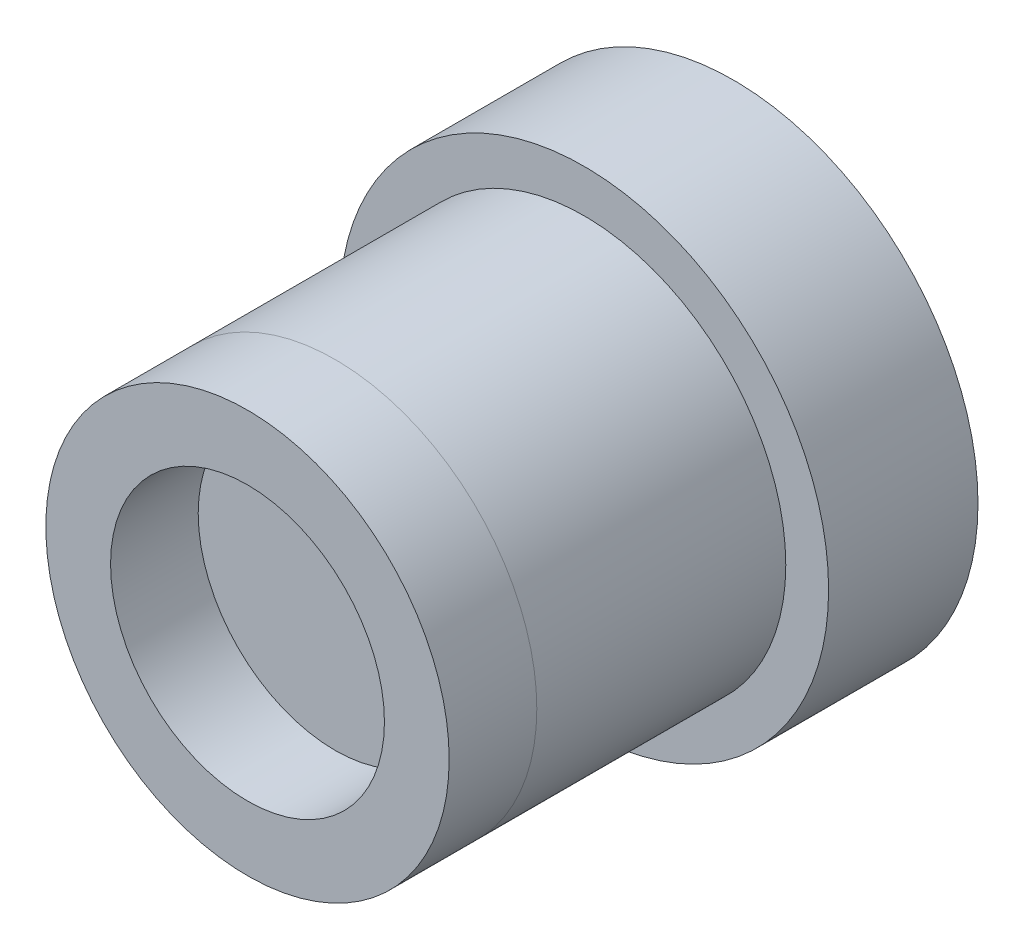
ISO-10303-21;
HEADER;
FILE_DESCRIPTION(('STEP AP214'),'2;1');
FILE_NAME('part.step','',(''),(''),'','','');
FILE_SCHEMA(('AUTOMOTIVE_DESIGN { 1 0 10303 214 1 1 1 1 }'));
ENDSEC;
DATA;
#1=APPLICATION_CONTEXT('core data for automotive mechanical design processes');
#2=APPLICATION_PROTOCOL_DEFINITION('international standard','automotive_design',2000,#1);
#3=PRODUCT_CONTEXT('',#1,'mechanical');
#4=PRODUCT('Part','Part','',(#3));
#5=PRODUCT_RELATED_PRODUCT_CATEGORY('part','',(#4));
#6=PRODUCT_DEFINITION_FORMATION('','',#4);
#7=PRODUCT_DEFINITION_CONTEXT('part definition',#1,'design');
#8=PRODUCT_DEFINITION('design','',#6,#7);
#9=PRODUCT_DEFINITION_SHAPE('','',#8);
#10=(LENGTH_UNIT() NAMED_UNIT(*) SI_UNIT(.MILLI.,.METRE.));
#11=(NAMED_UNIT(*) PLANE_ANGLE_UNIT() SI_UNIT($,.RADIAN.));
#12=(NAMED_UNIT(*) SI_UNIT($,.STERADIAN.) SOLID_ANGLE_UNIT());
#13=UNCERTAINTY_MEASURE_WITH_UNIT(LENGTH_MEASURE(1.E-05),#10,'distance_accuracy_value','');
#14=(GEOMETRIC_REPRESENTATION_CONTEXT(3) GLOBAL_UNCERTAINTY_ASSIGNED_CONTEXT((#13)) GLOBAL_UNIT_ASSIGNED_CONTEXT((#10,
#11,#12)) REPRESENTATION_CONTEXT('',''));
#15=CARTESIAN_POINT('',(0.,0.,0.));
#16=DIRECTION('',(0.,0.,1.));
#17=DIRECTION('',(1.,0.,0.));
#18=AXIS2_PLACEMENT_3D('',#15,#16,#17);
#19=CARTESIAN_POINT('',(0.,0.,9.76));
#20=DIRECTION('',(0.,0.,1.));
#21=DIRECTION('',(1.,0.,0.));
#22=AXIS2_PLACEMENT_3D('',#19,#20,#21);
#23=PLANE('',#22);
#24=CARTESIAN_POINT('',(0.,0.,9.76));
#25=DIRECTION('',(0.,0.,1.));
#26=DIRECTION('',(1.,0.,0.));
#27=AXIS2_PLACEMENT_3D('',#24,#25,#26);
#28=CIRCLE('',#27,4.05);
#29=CARTESIAN_POINT('',(4.05,0.,9.76));
#30=VERTEX_POINT('',#29);
#31=EDGE_CURVE('E11',#30,#30,#28,.T.);
#32=ORIENTED_EDGE('',*,*,#31,.T.);
#33=EDGE_LOOP('',(#32));
#34=FACE_BOUND('',#33,.T.);
#35=CARTESIAN_POINT('',(0.,0.,9.76));
#36=DIRECTION('',(0.,0.,1.));
#37=DIRECTION('',(1.,0.,0.));
#38=AXIS2_PLACEMENT_3D('',#35,#36,#37);
#39=CIRCLE('',#38,2.75);
#40=CARTESIAN_POINT('',(2.75,0.,9.76));
#41=VERTEX_POINT('',#40);
#42=EDGE_CURVE('E58',#41,#41,#39,.T.);
#43=ORIENTED_EDGE('',*,*,#42,.F.);
#44=EDGE_LOOP('',(#43));
#45=FACE_BOUND('',#44,.T.);
#46=ADVANCED_FACE('F47',(#34,#45),#23,.T.);
#47=CARTESIAN_POINT('',(0.,0.,8.));
#48=DIRECTION('',(0.,0.,1.));
#49=DIRECTION('',(1.,0.,0.));
#50=AXIS2_PLACEMENT_3D('',#47,#48,#49);
#51=PLANE('',#50);
#52=CARTESIAN_POINT('',(0.,0.,8.));
#53=DIRECTION('',(0.,0.,1.));
#54=DIRECTION('',(1.,0.,0.));
#55=AXIS2_PLACEMENT_3D('',#52,#53,#54);
#56=CIRCLE('',#55,4.05);
#57=CARTESIAN_POINT('',(4.05,0.,8.));
#58=VERTEX_POINT('',#57);
#59=EDGE_CURVE('E51',#58,#58,#56,.T.);
#60=ORIENTED_EDGE('',*,*,#59,.F.);
#61=EDGE_LOOP('',(#60));
#62=FACE_BOUND('',#61,.T.);
#63=CARTESIAN_POINT('',(0.,0.,8.));
#64=DIRECTION('',(0.,0.,1.));
#65=DIRECTION('',(1.,0.,0.));
#66=AXIS2_PLACEMENT_3D('',#63,#64,#65);
#67=CIRCLE('',#66,2.75);
#68=CARTESIAN_POINT('',(2.75,0.,8.));
#69=VERTEX_POINT('',#68);
#70=EDGE_CURVE('E60',#69,#69,#67,.T.);
#71=ORIENTED_EDGE('',*,*,#70,.T.);
#72=EDGE_LOOP('',(#71));
#73=FACE_BOUND('',#72,.T.);
#74=ADVANCED_FACE('F70',(#62,#73),#51,.F.);
#75=CARTESIAN_POINT('',(0.,0.,9.76));
#76=DIRECTION('',(0.,0.,-1.));
#77=DIRECTION('',(-1.,0.,0.));
#78=AXIS2_PLACEMENT_3D('',#75,#76,#77);
#79=CYLINDRICAL_SURFACE('',#78,4.05);
#80=ORIENTED_EDGE('',*,*,#31,.F.);
#81=EDGE_LOOP('',(#80));
#82=FACE_BOUND('',#81,.T.);
#83=ORIENTED_EDGE('',*,*,#59,.T.);
#84=EDGE_LOOP('',(#83));
#85=FACE_BOUND('',#84,.T.);
#86=ADVANCED_FACE('F49',(#82,#85),#79,.T.);
#87=CARTESIAN_POINT('',(0.,0.,9.76));
#88=DIRECTION('',(0.,0.,-1.));
#89=DIRECTION('',(-1.,0.,0.));
#90=AXIS2_PLACEMENT_3D('',#87,#88,#89);
#91=CYLINDRICAL_SURFACE('',#90,2.75);
#92=ORIENTED_EDGE('',*,*,#42,.T.);
#93=EDGE_LOOP('',(#92));
#94=FACE_BOUND('',#93,.T.);
#95=ORIENTED_EDGE('',*,*,#70,.F.);
#96=EDGE_LOOP('',(#95));
#97=FACE_BOUND('',#96,.T.);
#98=ADVANCED_FACE('F66',(#94,#97),#91,.F.);
#99=CLOSED_SHELL('',(#46,#74,#86,#98));
#100=MANIFOLD_SOLID_BREP('B2',#99);
#101=CARTESIAN_POINT('',(0.,0.,8.));
#102=DIRECTION('',(0.,0.,-1.));
#103=DIRECTION('',(-1.,0.,0.));
#104=AXIS2_PLACEMENT_3D('',#101,#102,#103);
#105=CYLINDRICAL_SURFACE('',#104,4.91);
#106=CARTESIAN_POINT('',(0.,0.,0.));
#107=DIRECTION('',(0.,0.,1.));
#108=DIRECTION('',(1.,0.,0.));
#109=AXIS2_PLACEMENT_3D('',#106,#107,#108);
#110=CIRCLE('',#109,4.91);
#111=CARTESIAN_POINT('',(4.91,0.,0.));
#112=VERTEX_POINT('',#111);
#113=EDGE_CURVE('E46',#112,#112,#110,.T.);
#114=ORIENTED_EDGE('',*,*,#113,.T.);
#115=EDGE_LOOP('',(#114));
#116=FACE_BOUND('',#115,.T.);
#117=CARTESIAN_POINT('',(0.,0.,3.));
#118=DIRECTION('',(0.,0.,1.));
#119=DIRECTION('',(1.,0.,0.));
#120=AXIS2_PLACEMENT_3D('',#117,#118,#119);
#121=CIRCLE('',#120,4.91);
#122=CARTESIAN_POINT('',(4.91,0.,3.));
#123=VERTEX_POINT('',#122);
#124=EDGE_CURVE('E115',#123,#123,#121,.T.);
#125=ORIENTED_EDGE('',*,*,#124,.F.);
#126=EDGE_LOOP('',(#125));
#127=FACE_BOUND('',#126,.T.);
#128=ADVANCED_FACE('F109',(#116,#127),#105,.T.);
#129=CARTESIAN_POINT('',(0.,0.,0.));
#130=DIRECTION('',(0.,0.,1.));
#131=DIRECTION('',(1.,0.,0.));
#132=AXIS2_PLACEMENT_3D('',#129,#130,#131);
#133=PLANE('',#132);
#134=ORIENTED_EDGE('',*,*,#113,.F.);
#135=EDGE_LOOP('',(#134));
#136=FACE_BOUND('',#135,.T.);
#137=ADVANCED_FACE('F141',(#136),#133,.F.);
#138=CARTESIAN_POINT('',(0.,0.,3.));
#139=DIRECTION('',(0.,0.,1.));
#140=DIRECTION('',(1.,0.,0.));
#141=AXIS2_PLACEMENT_3D('',#138,#139,#140);
#142=PLANE('',#141);
#143=CARTESIAN_POINT('',(0.,0.,3.));
#144=DIRECTION('',(0.,0.,1.));
#145=DIRECTION('',(1.,0.,0.));
#146=AXIS2_PLACEMENT_3D('',#143,#144,#145);
#147=CIRCLE('',#146,4.05);
#148=CARTESIAN_POINT('',(4.05,0.,3.));
#149=VERTEX_POINT('',#148);
#150=EDGE_CURVE('E119',#149,#149,#147,.T.);
#151=ORIENTED_EDGE('',*,*,#150,.F.);
#152=EDGE_LOOP('',(#151));
#153=FACE_BOUND('',#152,.T.);
#154=ORIENTED_EDGE('',*,*,#124,.T.);
#155=EDGE_LOOP('',(#154));
#156=FACE_BOUND('',#155,.T.);
#157=ADVANCED_FACE('F133',(#153,#156),#142,.T.);
#158=CARTESIAN_POINT('',(0.,0.,3.));
#159=DIRECTION('',(0.,0.,1.));
#160=DIRECTION('',(1.,0.,0.));
#161=AXIS2_PLACEMENT_3D('',#158,#159,#160);
#162=CYLINDRICAL_SURFACE('',#161,4.05);
#163=ORIENTED_EDGE('',*,*,#150,.T.);
#164=EDGE_LOOP('',(#163));
#165=FACE_BOUND('',#164,.T.);
#166=CARTESIAN_POINT('',(0.,0.,8.));
#167=DIRECTION('',(0.,0.,1.));
#168=DIRECTION('',(1.,0.,0.));
#169=AXIS2_PLACEMENT_3D('',#166,#167,#168);
#170=CIRCLE('',#169,4.05);
#171=CARTESIAN_POINT('',(4.05,0.,8.));
#172=VERTEX_POINT('',#171);
#173=EDGE_CURVE('E123',#172,#172,#170,.T.);
#174=ORIENTED_EDGE('',*,*,#173,.F.);
#175=EDGE_LOOP('',(#174));
#176=FACE_BOUND('',#175,.T.);
#177=ADVANCED_FACE('F131',(#165,#176),#162,.T.);
#178=CARTESIAN_POINT('',(0.,0.,8.));
#179=DIRECTION('',(0.,0.,1.));
#180=DIRECTION('',(1.,0.,0.));
#181=AXIS2_PLACEMENT_3D('',#178,#179,#180);
#182=PLANE('',#181);
#183=ORIENTED_EDGE('',*,*,#173,.T.);
#184=EDGE_LOOP('',(#183));
#185=FACE_BOUND('',#184,.T.);
#186=ADVANCED_FACE('F129',(#185),#182,.T.);
#187=CLOSED_SHELL('',(#128,#137,#157,#177,#186));
#188=MANIFOLD_SOLID_BREP('B6',#187);
#189=ADVANCED_BREP_SHAPE_REPRESENTATION('',(#18,#100,#188),#14);
#190=SHAPE_DEFINITION_REPRESENTATION(#9,#189);
ENDSEC;
END-ISO-10303-21;
